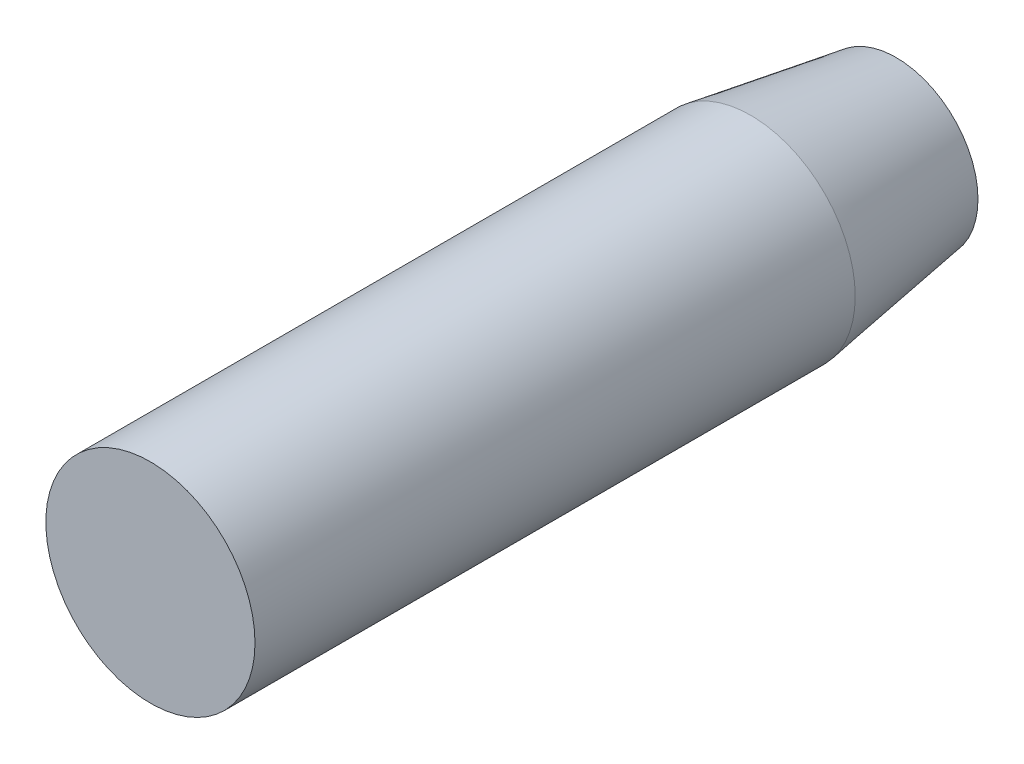
ISO-10303-21;
HEADER;
FILE_DESCRIPTION(('STEP AP214'),'2;1');
FILE_NAME('part.step','',(''),(''),'','','');
FILE_SCHEMA(('AUTOMOTIVE_DESIGN { 1 0 10303 214 1 1 1 1 }'));
ENDSEC;
DATA;
#1=APPLICATION_CONTEXT('core data for automotive mechanical design processes');
#2=APPLICATION_PROTOCOL_DEFINITION('international standard','automotive_design',2000,#1);
#3=PRODUCT_CONTEXT('',#1,'mechanical');
#4=PRODUCT('Part','Part','',(#3));
#5=PRODUCT_RELATED_PRODUCT_CATEGORY('part','',(#4));
#6=PRODUCT_DEFINITION_FORMATION('','',#4);
#7=PRODUCT_DEFINITION_CONTEXT('part definition',#1,'design');
#8=PRODUCT_DEFINITION('design','',#6,#7);
#9=PRODUCT_DEFINITION_SHAPE('','',#8);
#10=(LENGTH_UNIT() NAMED_UNIT(*) SI_UNIT(.MILLI.,.METRE.));
#11=(NAMED_UNIT(*) PLANE_ANGLE_UNIT() SI_UNIT($,.RADIAN.));
#12=(NAMED_UNIT(*) SI_UNIT($,.STERADIAN.) SOLID_ANGLE_UNIT());
#13=UNCERTAINTY_MEASURE_WITH_UNIT(LENGTH_MEASURE(1.E-05),#10,'distance_accuracy_value','');
#14=(GEOMETRIC_REPRESENTATION_CONTEXT(3) GLOBAL_UNCERTAINTY_ASSIGNED_CONTEXT((#13)) GLOBAL_UNIT_ASSIGNED_CONTEXT((#10,
#11,#12)) REPRESENTATION_CONTEXT('',''));
#15=CARTESIAN_POINT('',(0.,0.,0.));
#16=DIRECTION('',(0.,0.,1.));
#17=DIRECTION('',(1.,0.,0.));
#18=AXIS2_PLACEMENT_3D('',#15,#16,#17);
#19=CARTESIAN_POINT('',(0.,0.,-65.0875));
#20=DIRECTION('',(0.,0.,1.));
#21=DIRECTION('',(-1.,0.,0.));
#22=AXIS2_PLACEMENT_3D('',#19,#20,#21);
#23=CYLINDRICAL_SURFACE('',#22,18.25625);
#24=CARTESIAN_POINT('',(0.,0.,-39.6874999999998));
#25=DIRECTION('',(0.,0.,1.));
#26=DIRECTION('',(1.,0.,0.));
#27=AXIS2_PLACEMENT_3D('',#24,#25,#26);
#28=CIRCLE('',#27,18.25625);
#29=CARTESIAN_POINT('',(18.25625,0.,-39.6874999999998));
#30=VERTEX_POINT('',#29);
#31=EDGE_CURVE('E10',#30,#30,#28,.F.);
#32=ORIENTED_EDGE('',*,*,#31,.F.);
#33=EDGE_LOOP('',(#32));
#34=FACE_BOUND('',#33,.T.);
#35=CARTESIAN_POINT('',(0.,0.,65.0875));
#36=DIRECTION('',(0.,0.,1.));
#37=DIRECTION('',(1.,0.,0.));
#38=AXIS2_PLACEMENT_3D('',#35,#36,#37);
#39=CIRCLE('',#38,18.25625);
#40=CARTESIAN_POINT('',(18.25625,0.,65.0875));
#41=VERTEX_POINT('',#40);
#42=EDGE_CURVE('E57',#41,#41,#39,.T.);
#43=ORIENTED_EDGE('',*,*,#42,.F.);
#44=EDGE_LOOP('',(#43));
#45=FACE_BOUND('',#44,.T.);
#46=ADVANCED_FACE('F43',(#34,#45),#23,.T.);
#47=CARTESIAN_POINT('',(0.,0.,-65.0875));
#48=DIRECTION('',(0.,0.,-1.));
#49=DIRECTION('',(1.,0.,0.));
#50=AXIS2_PLACEMENT_3D('',#47,#48,#49);
#51=PLANE('',#50);
#52=CARTESIAN_POINT('',(0.,0.,-65.0875));
#53=DIRECTION('',(0.,0.,1.));
#54=DIRECTION('',(1.,0.,0.));
#55=AXIS2_PLACEMENT_3D('',#52,#53,#54);
#56=CIRCLE('',#55,14.2875000000001);
#57=CARTESIAN_POINT('',(14.2875000000001,0.,-65.0875));
#58=VERTEX_POINT('',#57);
#59=EDGE_CURVE('E51',#58,#58,#56,.T.);
#60=ORIENTED_EDGE('',*,*,#59,.F.);
#61=EDGE_LOOP('',(#60));
#62=FACE_BOUND('',#61,.T.);
#63=ADVANCED_FACE('F67',(#62),#51,.T.);
#64=CARTESIAN_POINT('',(0.,0.,65.0875));
#65=DIRECTION('',(0.,0.,-1.));
#66=DIRECTION('',(1.,0.,0.));
#67=AXIS2_PLACEMENT_3D('',#64,#65,#66);
#68=PLANE('',#67);
#69=ORIENTED_EDGE('',*,*,#42,.T.);
#70=EDGE_LOOP('',(#69));
#71=FACE_BOUND('',#70,.T.);
#72=ADVANCED_FACE('F64',(#71),#68,.F.);
#73=CARTESIAN_POINT('',(0.,0.,-65.0875));
#74=DIRECTION('',(0.,0.,1.));
#75=DIRECTION('',(-1.,0.,0.));
#76=AXIS2_PLACEMENT_3D('',#73,#74,#75);
#77=CONICAL_SURFACE('',#76,14.2875000000001,0.154996741923938);
#78=ORIENTED_EDGE('',*,*,#31,.T.);
#79=EDGE_LOOP('',(#78));
#80=FACE_BOUND('',#79,.T.);
#81=ORIENTED_EDGE('',*,*,#59,.T.);
#82=EDGE_LOOP('',(#81));
#83=FACE_BOUND('',#82,.T.);
#84=ADVANCED_FACE('F45',(#80,#83),#77,.T.);
#85=CLOSED_SHELL('',(#46,#63,#72,#84));
#86=MANIFOLD_SOLID_BREP('B2',#85);
#87=ADVANCED_BREP_SHAPE_REPRESENTATION('',(#18,#86),#14);
#88=SHAPE_DEFINITION_REPRESENTATION(#9,#87);
ENDSEC;
END-ISO-10303-21;
